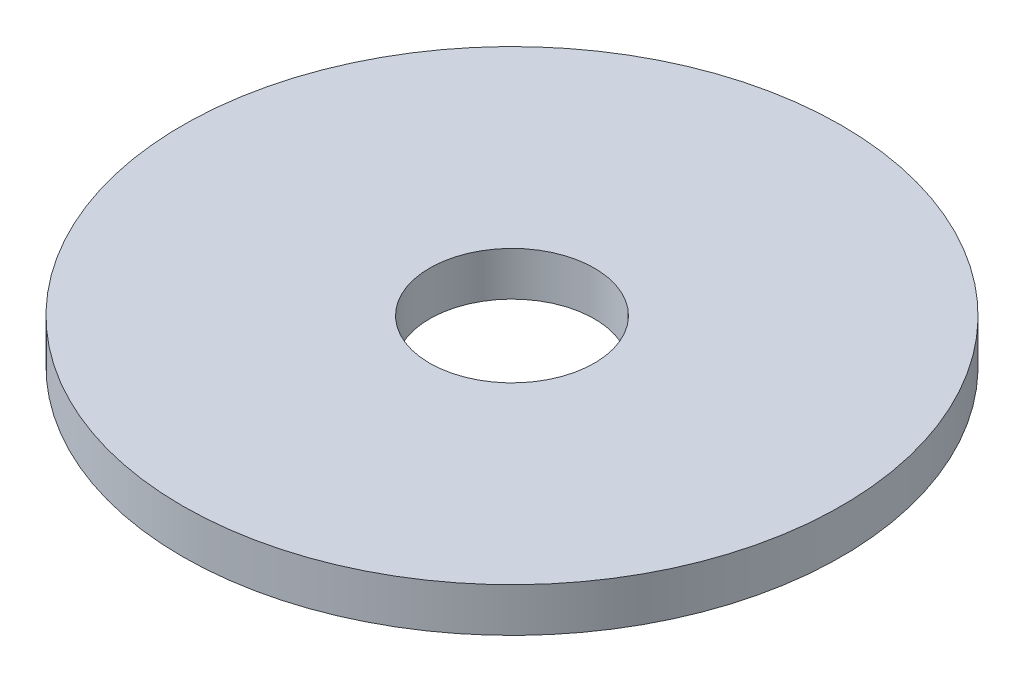
ISO-10303-21;
HEADER;
FILE_DESCRIPTION(('STEP AP214'),'2;1');
FILE_NAME('part.step','',(''),(''),'','','');
FILE_SCHEMA(('AUTOMOTIVE_DESIGN { 1 0 10303 214 1 1 1 1 }'));
ENDSEC;
DATA;
#1=APPLICATION_CONTEXT('core data for automotive mechanical design processes');
#2=APPLICATION_PROTOCOL_DEFINITION('international standard','automotive_design',2000,#1);
#3=PRODUCT_CONTEXT('',#1,'mechanical');
#4=PRODUCT('Part','Part','',(#3));
#5=PRODUCT_RELATED_PRODUCT_CATEGORY('part','',(#4));
#6=PRODUCT_DEFINITION_FORMATION('','',#4);
#7=PRODUCT_DEFINITION_CONTEXT('part definition',#1,'design');
#8=PRODUCT_DEFINITION('design','',#6,#7);
#9=PRODUCT_DEFINITION_SHAPE('','',#8);
#10=(LENGTH_UNIT() NAMED_UNIT(*) SI_UNIT(.MILLI.,.METRE.));
#11=(NAMED_UNIT(*) PLANE_ANGLE_UNIT() SI_UNIT($,.RADIAN.));
#12=(NAMED_UNIT(*) SI_UNIT($,.STERADIAN.) SOLID_ANGLE_UNIT());
#13=UNCERTAINTY_MEASURE_WITH_UNIT(LENGTH_MEASURE(1.E-05),#10,'distance_accuracy_value','');
#14=(GEOMETRIC_REPRESENTATION_CONTEXT(3) GLOBAL_UNCERTAINTY_ASSIGNED_CONTEXT((#13)) GLOBAL_UNIT_ASSIGNED_CONTEXT((#10,
#11,#12)) REPRESENTATION_CONTEXT('',''));
#15=CARTESIAN_POINT('',(0.,0.,0.));
#16=DIRECTION('',(0.,0.,1.));
#17=DIRECTION('',(1.,0.,0.));
#18=AXIS2_PLACEMENT_3D('',#15,#16,#17);
#19=CARTESIAN_POINT('',(0.,0.5,0.));
#20=DIRECTION('',(0.,1.,0.));
#21=DIRECTION('',(0.,0.,1.));
#22=AXIS2_PLACEMENT_3D('',#19,#20,#21);
#23=PLANE('',#22);
#24=CARTESIAN_POINT('',(0.,0.5,0.));
#25=DIRECTION('',(0.,1.,0.));
#26=DIRECTION('',(0.,0.,1.));
#27=AXIS2_PLACEMENT_3D('',#24,#25,#26);
#28=CIRCLE('',#27,7.5);
#29=CARTESIAN_POINT('',(0.,0.5,7.5));
#30=VERTEX_POINT('',#29);
#31=EDGE_CURVE('E10',#30,#30,#28,.T.);
#32=ORIENTED_EDGE('',*,*,#31,.T.);
#33=EDGE_LOOP('',(#32));
#34=FACE_BOUND('',#33,.T.);
#35=CARTESIAN_POINT('',(0.,0.5,0.));
#36=DIRECTION('',(0.,1.,0.));
#37=DIRECTION('',(0.,0.,1.));
#38=AXIS2_PLACEMENT_3D('',#35,#36,#37);
#39=CIRCLE('',#38,1.875);
#40=CARTESIAN_POINT('',(0.,0.5,1.875));
#41=VERTEX_POINT('',#40);
#42=EDGE_CURVE('E42',#41,#41,#39,.T.);
#43=ORIENTED_EDGE('',*,*,#42,.F.);
#44=EDGE_LOOP('',(#43));
#45=FACE_BOUND('',#44,.T.);
#46=ADVANCED_FACE('F31',(#34,#45),#23,.T.);
#47=CARTESIAN_POINT('',(0.,-0.5,0.));
#48=DIRECTION('',(0.,1.,0.));
#49=DIRECTION('',(0.,0.,1.));
#50=AXIS2_PLACEMENT_3D('',#47,#48,#49);
#51=PLANE('',#50);
#52=CARTESIAN_POINT('',(0.,-0.5,0.));
#53=DIRECTION('',(0.,1.,0.));
#54=DIRECTION('',(0.,0.,1.));
#55=AXIS2_PLACEMENT_3D('',#52,#53,#54);
#56=CIRCLE('',#55,7.5);
#57=CARTESIAN_POINT('',(0.,-0.5,7.5));
#58=VERTEX_POINT('',#57);
#59=EDGE_CURVE('E35',#58,#58,#56,.T.);
#60=ORIENTED_EDGE('',*,*,#59,.F.);
#61=EDGE_LOOP('',(#60));
#62=FACE_BOUND('',#61,.T.);
#63=CARTESIAN_POINT('',(0.,-0.5,0.));
#64=DIRECTION('',(0.,1.,0.));
#65=DIRECTION('',(0.,0.,1.));
#66=AXIS2_PLACEMENT_3D('',#63,#64,#65);
#67=CIRCLE('',#66,1.875);
#68=CARTESIAN_POINT('',(0.,-0.5,1.875));
#69=VERTEX_POINT('',#68);
#70=EDGE_CURVE('E44',#69,#69,#67,.T.);
#71=ORIENTED_EDGE('',*,*,#70,.T.);
#72=EDGE_LOOP('',(#71));
#73=FACE_BOUND('',#72,.T.);
#74=ADVANCED_FACE('F54',(#62,#73),#51,.F.);
#75=CARTESIAN_POINT('',(0.,0.5,0.));
#76=DIRECTION('',(0.,-1.,0.));
#77=DIRECTION('',(0.,0.,-1.));
#78=AXIS2_PLACEMENT_3D('',#75,#76,#77);
#79=CYLINDRICAL_SURFACE('',#78,7.5);
#80=ORIENTED_EDGE('',*,*,#31,.F.);
#81=EDGE_LOOP('',(#80));
#82=FACE_BOUND('',#81,.T.);
#83=ORIENTED_EDGE('',*,*,#59,.T.);
#84=EDGE_LOOP('',(#83));
#85=FACE_BOUND('',#84,.T.);
#86=ADVANCED_FACE('F33',(#82,#85),#79,.T.);
#87=CARTESIAN_POINT('',(0.,0.5,0.));
#88=DIRECTION('',(0.,-1.,0.));
#89=DIRECTION('',(0.,0.,-1.));
#90=AXIS2_PLACEMENT_3D('',#87,#88,#89);
#91=CYLINDRICAL_SURFACE('',#90,1.875);
#92=ORIENTED_EDGE('',*,*,#42,.T.);
#93=EDGE_LOOP('',(#92));
#94=FACE_BOUND('',#93,.T.);
#95=ORIENTED_EDGE('',*,*,#70,.F.);
#96=EDGE_LOOP('',(#95));
#97=FACE_BOUND('',#96,.T.);
#98=ADVANCED_FACE('F50',(#94,#97),#91,.F.);
#99=CLOSED_SHELL('',(#46,#74,#86,#98));
#100=MANIFOLD_SOLID_BREP('B2',#99);
#101=ADVANCED_BREP_SHAPE_REPRESENTATION('',(#18,#100),#14);
#102=SHAPE_DEFINITION_REPRESENTATION(#9,#101);
ENDSEC;
END-ISO-10303-21;
